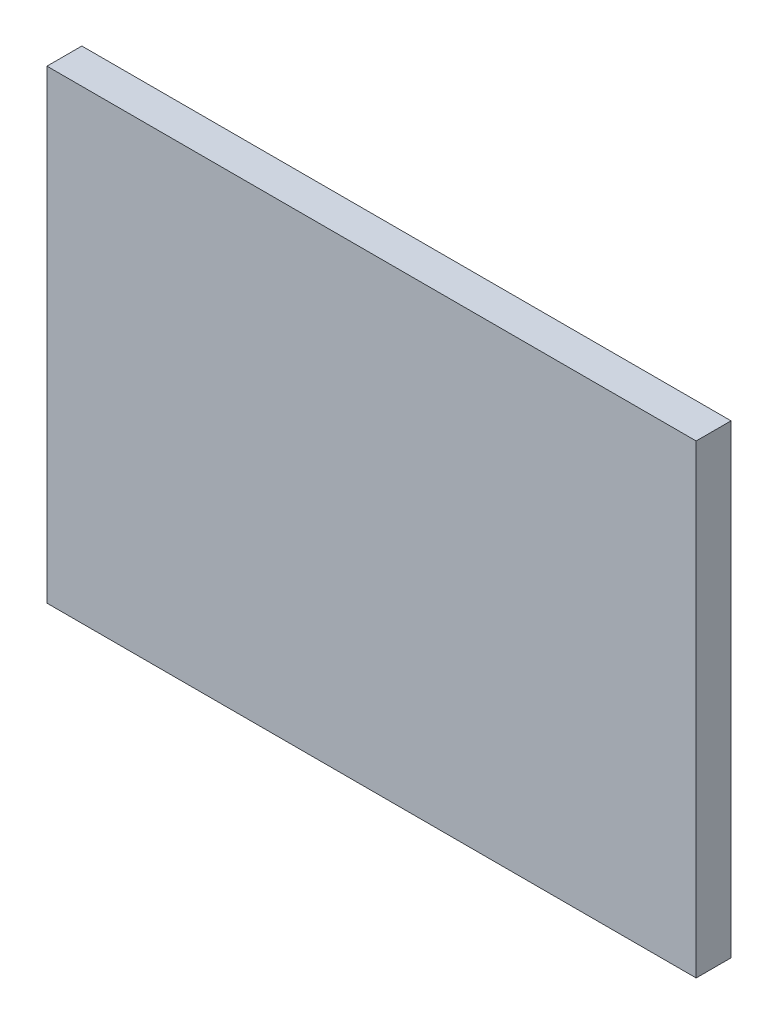
ISO-10303-21;
HEADER;
FILE_DESCRIPTION(('STEP AP214'),'2;1');
FILE_NAME('part.step','',(''),(''),'','','');
FILE_SCHEMA(('AUTOMOTIVE_DESIGN { 1 0 10303 214 1 1 1 1 }'));
ENDSEC;
DATA;
#1=APPLICATION_CONTEXT('core data for automotive mechanical design processes');
#2=APPLICATION_PROTOCOL_DEFINITION('international standard','automotive_design',2000,#1);
#3=PRODUCT_CONTEXT('',#1,'mechanical');
#4=PRODUCT('Part','Part','',(#3));
#5=PRODUCT_RELATED_PRODUCT_CATEGORY('part','',(#4));
#6=PRODUCT_DEFINITION_FORMATION('','',#4);
#7=PRODUCT_DEFINITION_CONTEXT('part definition',#1,'design');
#8=PRODUCT_DEFINITION('design','',#6,#7);
#9=PRODUCT_DEFINITION_SHAPE('','',#8);
#10=(LENGTH_UNIT() NAMED_UNIT(*) SI_UNIT(.MILLI.,.METRE.));
#11=(NAMED_UNIT(*) PLANE_ANGLE_UNIT() SI_UNIT($,.RADIAN.));
#12=(NAMED_UNIT(*) SI_UNIT($,.STERADIAN.) SOLID_ANGLE_UNIT());
#13=UNCERTAINTY_MEASURE_WITH_UNIT(LENGTH_MEASURE(1.E-05),#10,'distance_accuracy_value','');
#14=(GEOMETRIC_REPRESENTATION_CONTEXT(3) GLOBAL_UNCERTAINTY_ASSIGNED_CONTEXT((#13)) GLOBAL_UNIT_ASSIGNED_CONTEXT((#10,
#11,#12)) REPRESENTATION_CONTEXT('',''));
#15=CARTESIAN_POINT('',(0.,0.,0.));
#16=DIRECTION('',(0.,0.,1.));
#17=DIRECTION('',(1.,0.,0.));
#18=AXIS2_PLACEMENT_3D('',#15,#16,#17);
#19=CARTESIAN_POINT('',(-4978.4,1371.6,-11.43));
#20=DIRECTION('',(0.,1.,0.));
#21=DIRECTION('',(0.,0.,1.));
#22=AXIS2_PLACEMENT_3D('',#19,#20,#21);
#23=PLANE('',#22);
#24=DIRECTION('',(-1.,0.,0.));
#25=VECTOR('',#24,1.);
#26=CARTESIAN_POINT('',(-4978.4,1371.6,0.));
#27=LINE('',#26,#25);
#28=CARTESIAN_POINT('',(-4765.675,1371.6,0.));
#29=VERTEX_POINT('',#28);
#30=CARTESIAN_POINT('',(-4978.4,1371.6,0.));
#31=VERTEX_POINT('',#30);
#32=EDGE_CURVE('E95',#29,#31,#27,.T.);
#33=ORIENTED_EDGE('',*,*,#32,.F.);
#34=DIRECTION('',(0.,0.,1.));
#35=VECTOR('',#34,1.);
#36=CARTESIAN_POINT('',(-4765.675,1371.6,-11.43));
#37=LINE('',#36,#35);
#38=CARTESIAN_POINT('',(-4765.675,1371.6,-11.43));
#39=VERTEX_POINT('',#38);
#40=EDGE_CURVE('E11',#39,#29,#37,.T.);
#41=ORIENTED_EDGE('',*,*,#40,.F.);
#42=DIRECTION('',(-1.,0.,0.));
#43=VECTOR('',#42,1.);
#44=CARTESIAN_POINT('',(-4978.4,1371.6,-11.43));
#45=LINE('',#44,#43);
#46=CARTESIAN_POINT('',(-4978.4,1371.6,-11.43));
#47=VERTEX_POINT('',#46);
#48=EDGE_CURVE('E89',#39,#47,#45,.T.);
#49=ORIENTED_EDGE('',*,*,#48,.T.);
#50=DIRECTION('',(0.,0.,1.));
#51=VECTOR('',#50,1.);
#52=CARTESIAN_POINT('',(-4978.4,1371.6,-11.43));
#53=LINE('',#52,#51);
#54=EDGE_CURVE('E34',#47,#31,#53,.T.);
#55=ORIENTED_EDGE('',*,*,#54,.T.);
#56=EDGE_LOOP('',(#33,#41,#49,#55));
#57=FACE_BOUND('',#56,.T.);
#58=ADVANCED_FACE('F31',(#57),#23,.T.);
#59=CARTESIAN_POINT('',(-4765.675,1371.6,-11.43));
#60=DIRECTION('',(1.,0.,0.));
#61=DIRECTION('',(0.,0.,-1.));
#62=AXIS2_PLACEMENT_3D('',#59,#60,#61);
#63=PLANE('',#62);
#64=DIRECTION('',(0.,1.,0.));
#65=VECTOR('',#64,1.);
#66=CARTESIAN_POINT('',(-4765.675,1371.6,0.));
#67=LINE('',#66,#65);
#68=CARTESIAN_POINT('',(-4765.675,1219.2,0.));
#69=VERTEX_POINT('',#68);
#70=EDGE_CURVE('E91',#69,#29,#67,.T.);
#71=ORIENTED_EDGE('',*,*,#70,.F.);
#72=DIRECTION('',(0.,0.,1.));
#73=VECTOR('',#72,1.);
#74=CARTESIAN_POINT('',(-4765.675,1219.2,-11.43));
#75=LINE('',#74,#73);
#76=CARTESIAN_POINT('',(-4765.675,1219.2,-11.43));
#77=VERTEX_POINT('',#76);
#78=EDGE_CURVE('E40',#77,#69,#75,.T.);
#79=ORIENTED_EDGE('',*,*,#78,.F.);
#80=DIRECTION('',(0.,1.,0.));
#81=VECTOR('',#80,1.);
#82=CARTESIAN_POINT('',(-4765.675,1371.6,-11.43));
#83=LINE('',#82,#81);
#84=EDGE_CURVE('E86',#77,#39,#83,.T.);
#85=ORIENTED_EDGE('',*,*,#84,.T.);
#86=ORIENTED_EDGE('',*,*,#40,.T.);
#87=EDGE_LOOP('',(#71,#79,#85,#86));
#88=FACE_BOUND('',#87,.T.);
#89=ADVANCED_FACE('F105',(#88),#63,.T.);
#90=CARTESIAN_POINT('',(-4765.675,1219.2,-11.43));
#91=DIRECTION('',(0.,-1.,0.));
#92=DIRECTION('',(0.,0.,-1.));
#93=AXIS2_PLACEMENT_3D('',#90,#91,#92);
#94=PLANE('',#93);
#95=DIRECTION('',(1.,0.,0.));
#96=VECTOR('',#95,1.);
#97=CARTESIAN_POINT('',(-4765.675,1219.2,0.));
#98=LINE('',#97,#96);
#99=CARTESIAN_POINT('',(-4978.4,1219.2,0.));
#100=VERTEX_POINT('',#99);
#101=EDGE_CURVE('E81',#100,#69,#98,.T.);
#102=ORIENTED_EDGE('',*,*,#101,.F.);
#103=DIRECTION('',(0.,0.,1.));
#104=VECTOR('',#103,1.);
#105=CARTESIAN_POINT('',(-4978.4,1219.2,-11.43));
#106=LINE('',#105,#104);
#107=CARTESIAN_POINT('',(-4978.4,1219.2,-11.43));
#108=VERTEX_POINT('',#107);
#109=EDGE_CURVE('E76',#108,#100,#106,.T.);
#110=ORIENTED_EDGE('',*,*,#109,.F.);
#111=DIRECTION('',(1.,0.,0.));
#112=VECTOR('',#111,1.);
#113=CARTESIAN_POINT('',(-4765.675,1219.2,-11.43));
#114=LINE('',#113,#112);
#115=EDGE_CURVE('E79',#108,#77,#114,.T.);
#116=ORIENTED_EDGE('',*,*,#115,.T.);
#117=ORIENTED_EDGE('',*,*,#78,.T.);
#118=EDGE_LOOP('',(#102,#110,#116,#117));
#119=FACE_BOUND('',#118,.T.);
#120=ADVANCED_FACE('F78',(#119),#94,.T.);
#121=CARTESIAN_POINT('',(-4978.4,1219.2,-11.43));
#122=DIRECTION('',(-1.,0.,0.));
#123=DIRECTION('',(0.,0.,1.));
#124=AXIS2_PLACEMENT_3D('',#121,#122,#123);
#125=PLANE('',#124);
#126=DIRECTION('',(0.,-1.,0.));
#127=VECTOR('',#126,1.);
#128=CARTESIAN_POINT('',(-4978.4,1219.2,0.));
#129=LINE('',#128,#127);
#130=EDGE_CURVE('E98',#31,#100,#129,.T.);
#131=ORIENTED_EDGE('',*,*,#130,.F.);
#132=ORIENTED_EDGE('',*,*,#54,.F.);
#133=DIRECTION('',(0.,-1.,0.));
#134=VECTOR('',#133,1.);
#135=CARTESIAN_POINT('',(-4978.4,1219.2,-11.43));
#136=LINE('',#135,#134);
#137=EDGE_CURVE('E85',#47,#108,#136,.T.);
#138=ORIENTED_EDGE('',*,*,#137,.T.);
#139=ORIENTED_EDGE('',*,*,#109,.T.);
#140=EDGE_LOOP('',(#131,#132,#138,#139));
#141=FACE_BOUND('',#140,.T.);
#142=ADVANCED_FACE('F88',(#141),#125,.T.);
#143=CARTESIAN_POINT('',(-4765.675,1371.6,-11.43));
#144=DIRECTION('',(0.,0.,-1.));
#145=DIRECTION('',(-1.,0.,0.));
#146=AXIS2_PLACEMENT_3D('',#143,#144,#145);
#147=PLANE('',#146);
#148=ORIENTED_EDGE('',*,*,#48,.F.);
#149=ORIENTED_EDGE('',*,*,#84,.F.);
#150=ORIENTED_EDGE('',*,*,#115,.F.);
#151=ORIENTED_EDGE('',*,*,#137,.F.);
#152=EDGE_LOOP('',(#148,#149,#150,#151));
#153=FACE_BOUND('',#152,.T.);
#154=ADVANCED_FACE('F84',(#153),#147,.T.);
#155=CARTESIAN_POINT('',(-4765.675,1371.6,0.));
#156=DIRECTION('',(0.,0.,-1.));
#157=DIRECTION('',(-1.,0.,0.));
#158=AXIS2_PLACEMENT_3D('',#155,#156,#157);
#159=PLANE('',#158);
#160=ORIENTED_EDGE('',*,*,#32,.T.);
#161=ORIENTED_EDGE('',*,*,#130,.T.);
#162=ORIENTED_EDGE('',*,*,#101,.T.);
#163=ORIENTED_EDGE('',*,*,#70,.T.);
#164=EDGE_LOOP('',(#160,#161,#162,#163));
#165=FACE_BOUND('',#164,.T.);
#166=ADVANCED_FACE('F104',(#165),#159,.F.);
#167=CLOSED_SHELL('',(#58,#89,#120,#142,#154,#166));
#168=MANIFOLD_SOLID_BREP('B2',#167);
#169=ADVANCED_BREP_SHAPE_REPRESENTATION('',(#18,#168),#14);
#170=SHAPE_DEFINITION_REPRESENTATION(#9,#169);
ENDSEC;
END-ISO-10303-21;
